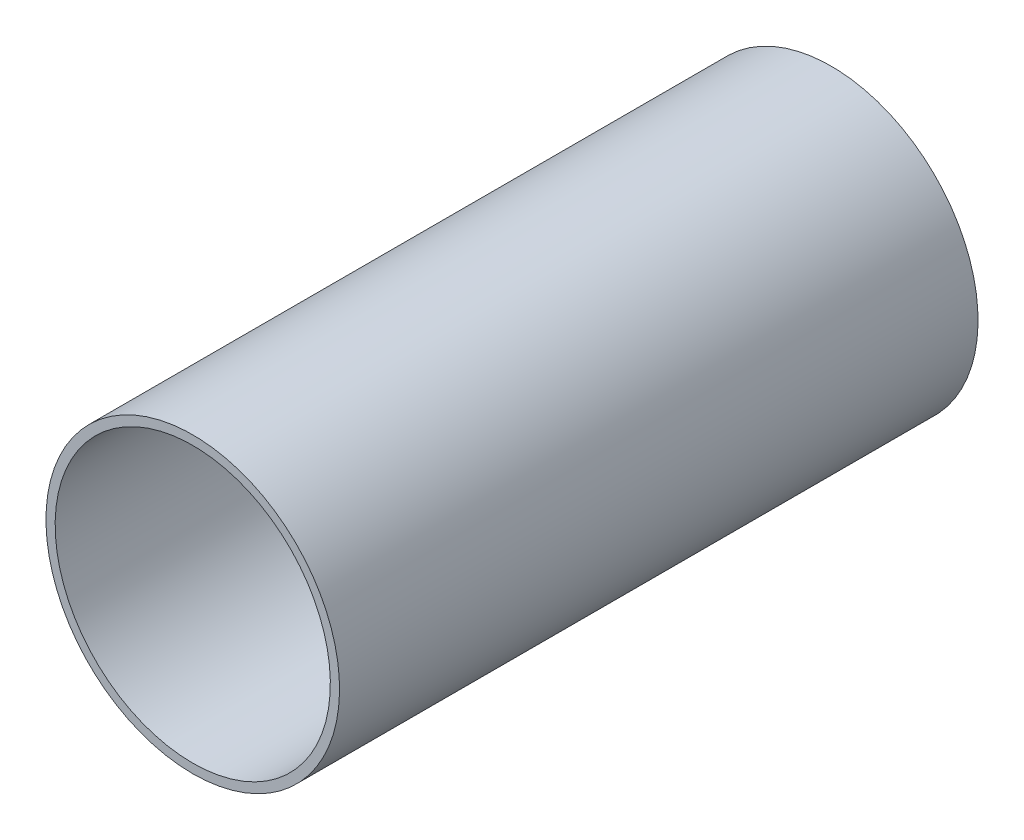
ISO-10303-21;
HEADER;
FILE_DESCRIPTION(('STEP AP214'),'2;1');
FILE_NAME('part.step','',(''),(''),'','','');
FILE_SCHEMA(('AUTOMOTIVE_DESIGN { 1 0 10303 214 1 1 1 1 }'));
ENDSEC;
DATA;
#1=APPLICATION_CONTEXT('core data for automotive mechanical design processes');
#2=APPLICATION_PROTOCOL_DEFINITION('international standard','automotive_design',2000,#1);
#3=PRODUCT_CONTEXT('',#1,'mechanical');
#4=PRODUCT('Part','Part','',(#3));
#5=PRODUCT_RELATED_PRODUCT_CATEGORY('part','',(#4));
#6=PRODUCT_DEFINITION_FORMATION('','',#4);
#7=PRODUCT_DEFINITION_CONTEXT('part definition',#1,'design');
#8=PRODUCT_DEFINITION('design','',#6,#7);
#9=PRODUCT_DEFINITION_SHAPE('','',#8);
#10=(LENGTH_UNIT() NAMED_UNIT(*) SI_UNIT(.MILLI.,.METRE.));
#11=(NAMED_UNIT(*) PLANE_ANGLE_UNIT() SI_UNIT($,.RADIAN.));
#12=(NAMED_UNIT(*) SI_UNIT($,.STERADIAN.) SOLID_ANGLE_UNIT());
#13=UNCERTAINTY_MEASURE_WITH_UNIT(LENGTH_MEASURE(1.E-05),#10,'distance_accuracy_value','');
#14=(GEOMETRIC_REPRESENTATION_CONTEXT(3) GLOBAL_UNCERTAINTY_ASSIGNED_CONTEXT((#13)) GLOBAL_UNIT_ASSIGNED_CONTEXT((#10,
#11,#12)) REPRESENTATION_CONTEXT('',''));
#15=CARTESIAN_POINT('',(0.,0.,0.));
#16=DIRECTION('',(0.,0.,1.));
#17=DIRECTION('',(1.,0.,0.));
#18=AXIS2_PLACEMENT_3D('',#15,#16,#17);
#19=CARTESIAN_POINT('',(162.56,-103.632,-0.045));
#20=DIRECTION('',(0.,0.,-1.));
#21=DIRECTION('',(0.,-1.,0.));
#22=AXIS2_PLACEMENT_3D('',#19,#20,#21);
#23=CYLINDRICAL_SURFACE('',#22,0.375);
#24=CARTESIAN_POINT('',(162.56,-103.632,-0.035));
#25=DIRECTION('',(0.,0.,-1.));
#26=DIRECTION('',(0.,-1.,0.));
#27=AXIS2_PLACEMENT_3D('',#24,#25,#26);
#28=CIRCLE('',#27,0.375);
#29=CARTESIAN_POINT('',(162.56,-104.007,-0.035));
#30=VERTEX_POINT('',#29);
#31=EDGE_CURVE('E64',#30,#30,#28,.T.);
#32=ORIENTED_EDGE('',*,*,#31,.T.);
#33=DIRECTION('',(0.,0.,1.));
#34=VECTOR('',#33,1.);
#35=CARTESIAN_POINT('',(162.56,-104.007,-0.045));
#36=LINE('',#35,#34);
#37=CARTESIAN_POINT('',(162.56,-104.007,1.705));
#38=VERTEX_POINT('',#37);
#39=EDGE_CURVE('E11',#30,#38,#36,.T.);
#40=ORIENTED_EDGE('',*,*,#39,.T.);
#41=CARTESIAN_POINT('',(162.56,-103.632,1.705));
#42=DIRECTION('',(0.,0.,-1.));
#43=DIRECTION('',(0.,-1.,0.));
#44=AXIS2_PLACEMENT_3D('',#41,#42,#43);
#45=CIRCLE('',#44,0.375);
#46=EDGE_CURVE('E20',#38,#38,#45,.T.);
#47=ORIENTED_EDGE('',*,*,#46,.F.);
#48=ORIENTED_EDGE('',*,*,#39,.F.);
#49=EDGE_LOOP('',(#32,#40,#47,#48));
#50=FACE_BOUND('',#49,.T.);
#51=ADVANCED_FACE('F17',(#50),#23,.F.);
#52=CARTESIAN_POINT('',(162.56,-104.032,1.705));
#53=DIRECTION('',(0.,0.,1.));
#54=DIRECTION('',(1.,0.,0.));
#55=AXIS2_PLACEMENT_3D('',#52,#53,#54);
#56=PLANE('',#55);
#57=ORIENTED_EDGE('',*,*,#46,.T.);
#58=EDGE_LOOP('',(#57));
#59=FACE_BOUND('',#58,.T.);
#60=CARTESIAN_POINT('',(162.56,-103.632,1.705));
#61=DIRECTION('',(0.,0.,1.));
#62=DIRECTION('',(0.,-1.,0.));
#63=AXIS2_PLACEMENT_3D('',#60,#61,#62);
#64=CIRCLE('',#63,0.4);
#65=CARTESIAN_POINT('',(162.56,-104.032,1.705));
#66=VERTEX_POINT('',#65);
#67=EDGE_CURVE('E56',#66,#66,#64,.T.);
#68=ORIENTED_EDGE('',*,*,#67,.T.);
#69=EDGE_LOOP('',(#68));
#70=FACE_BOUND('',#69,.T.);
#71=ADVANCED_FACE('F76',(#59,#70),#56,.T.);
#72=CARTESIAN_POINT('',(162.56,-104.032,-0.035));
#73=DIRECTION('',(0.,0.,1.));
#74=DIRECTION('',(1.,0.,0.));
#75=AXIS2_PLACEMENT_3D('',#72,#73,#74);
#76=PLANE('',#75);
#77=ORIENTED_EDGE('',*,*,#31,.F.);
#78=EDGE_LOOP('',(#77));
#79=FACE_BOUND('',#78,.T.);
#80=CARTESIAN_POINT('',(162.56,-103.632,-0.035));
#81=DIRECTION('',(0.,0.,1.));
#82=DIRECTION('',(0.,-1.,0.));
#83=AXIS2_PLACEMENT_3D('',#80,#81,#82);
#84=CIRCLE('',#83,0.4);
#85=CARTESIAN_POINT('',(162.56,-104.032,-0.035));
#86=VERTEX_POINT('',#85);
#87=EDGE_CURVE('E55',#86,#86,#84,.T.);
#88=ORIENTED_EDGE('',*,*,#87,.F.);
#89=EDGE_LOOP('',(#88));
#90=FACE_BOUND('',#89,.T.);
#91=ADVANCED_FACE('F84',(#79,#90),#76,.F.);
#92=CARTESIAN_POINT('',(162.56,-103.632,-0.035));
#93=DIRECTION('',(0.,0.,-1.));
#94=DIRECTION('',(0.,-1.,0.));
#95=AXIS2_PLACEMENT_3D('',#92,#93,#94);
#96=CYLINDRICAL_SURFACE('',#95,0.4);
#97=ORIENTED_EDGE('',*,*,#87,.T.);
#98=DIRECTION('',(0.,0.,1.));
#99=VECTOR('',#98,1.);
#100=CARTESIAN_POINT('',(162.56,-104.032,-0.035));
#101=LINE('',#100,#99);
#102=EDGE_CURVE('E52',#86,#66,#101,.T.);
#103=ORIENTED_EDGE('',*,*,#102,.T.);
#104=ORIENTED_EDGE('',*,*,#67,.F.);
#105=ORIENTED_EDGE('',*,*,#102,.F.);
#106=EDGE_LOOP('',(#97,#103,#104,#105));
#107=FACE_BOUND('',#106,.T.);
#108=ADVANCED_FACE('F53',(#107),#96,.T.);
#109=CLOSED_SHELL('',(#51,#71,#91,#108));
#110=MANIFOLD_SOLID_BREP('B1',#109);
#111=ADVANCED_BREP_SHAPE_REPRESENTATION('',(#18,#110),#14);
#112=SHAPE_DEFINITION_REPRESENTATION(#9,#111);
ENDSEC;
END-ISO-10303-21;
